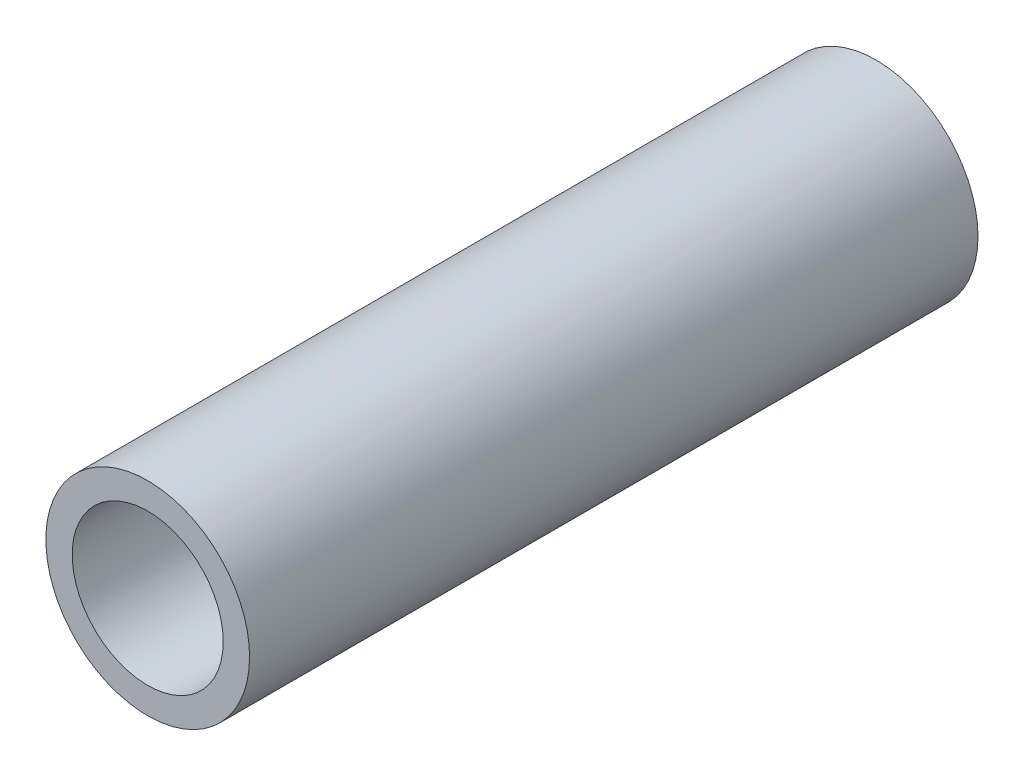
ISO-10303-21;
HEADER;
FILE_DESCRIPTION(('STEP AP214'),'2;1');
FILE_NAME('part.step','',(''),(''),'','','');
FILE_SCHEMA(('AUTOMOTIVE_DESIGN { 1 0 10303 214 1 1 1 1 }'));
ENDSEC;
DATA;
#1=APPLICATION_CONTEXT('core data for automotive mechanical design processes');
#2=APPLICATION_PROTOCOL_DEFINITION('international standard','automotive_design',2000,#1);
#3=PRODUCT_CONTEXT('',#1,'mechanical');
#4=PRODUCT('Part','Part','',(#3));
#5=PRODUCT_RELATED_PRODUCT_CATEGORY('part','',(#4));
#6=PRODUCT_DEFINITION_FORMATION('','',#4);
#7=PRODUCT_DEFINITION_CONTEXT('part definition',#1,'design');
#8=PRODUCT_DEFINITION('design','',#6,#7);
#9=PRODUCT_DEFINITION_SHAPE('','',#8);
#10=(LENGTH_UNIT() NAMED_UNIT(*) SI_UNIT(.MILLI.,.METRE.));
#11=(NAMED_UNIT(*) PLANE_ANGLE_UNIT() SI_UNIT($,.RADIAN.));
#12=(NAMED_UNIT(*) SI_UNIT($,.STERADIAN.) SOLID_ANGLE_UNIT());
#13=UNCERTAINTY_MEASURE_WITH_UNIT(LENGTH_MEASURE(1.E-05),#10,'distance_accuracy_value','');
#14=(GEOMETRIC_REPRESENTATION_CONTEXT(3) GLOBAL_UNCERTAINTY_ASSIGNED_CONTEXT((#13)) GLOBAL_UNIT_ASSIGNED_CONTEXT((#10,
#11,#12)) REPRESENTATION_CONTEXT('',''));
#15=CARTESIAN_POINT('',(0.,0.,0.));
#16=DIRECTION('',(0.,0.,1.));
#17=DIRECTION('',(1.,0.,0.));
#18=AXIS2_PLACEMENT_3D('',#15,#16,#17);
#19=CARTESIAN_POINT('',(0.,0.,76.2));
#20=DIRECTION('',(0.,0.,1.));
#21=DIRECTION('',(1.,0.,0.));
#22=AXIS2_PLACEMENT_3D('',#19,#20,#21);
#23=PLANE('',#22);
#24=CARTESIAN_POINT('',(0.,0.,76.2));
#25=DIRECTION('',(0.,0.,1.));
#26=DIRECTION('',(1.,0.,0.));
#27=AXIS2_PLACEMENT_3D('',#24,#25,#26);
#28=CIRCLE('',#27,10.6553);
#29=CARTESIAN_POINT('',(10.6553,0.,76.2));
#30=VERTEX_POINT('',#29);
#31=EDGE_CURVE('E10',#30,#30,#28,.T.);
#32=ORIENTED_EDGE('',*,*,#31,.T.);
#33=EDGE_LOOP('',(#32));
#34=FACE_BOUND('',#33,.T.);
#35=CARTESIAN_POINT('',(0.,0.,76.2));
#36=DIRECTION('',(0.,0.,1.));
#37=DIRECTION('',(1.,0.,0.));
#38=AXIS2_PLACEMENT_3D('',#35,#36,#37);
#39=CIRCLE('',#38,7.8994);
#40=CARTESIAN_POINT('',(7.8994,0.,76.2));
#41=VERTEX_POINT('',#40);
#42=EDGE_CURVE('E41',#41,#41,#39,.T.);
#43=ORIENTED_EDGE('',*,*,#42,.F.);
#44=EDGE_LOOP('',(#43));
#45=FACE_BOUND('',#44,.T.);
#46=ADVANCED_FACE('F30',(#34,#45),#23,.T.);
#47=CARTESIAN_POINT('',(0.,0.,0.));
#48=DIRECTION('',(0.,0.,1.));
#49=DIRECTION('',(1.,0.,0.));
#50=AXIS2_PLACEMENT_3D('',#47,#48,#49);
#51=PLANE('',#50);
#52=CARTESIAN_POINT('',(0.,0.,0.));
#53=DIRECTION('',(0.,0.,1.));
#54=DIRECTION('',(1.,0.,0.));
#55=AXIS2_PLACEMENT_3D('',#52,#53,#54);
#56=CIRCLE('',#55,10.6553);
#57=CARTESIAN_POINT('',(10.6553,0.,0.));
#58=VERTEX_POINT('',#57);
#59=EDGE_CURVE('E34',#58,#58,#56,.T.);
#60=ORIENTED_EDGE('',*,*,#59,.F.);
#61=EDGE_LOOP('',(#60));
#62=FACE_BOUND('',#61,.T.);
#63=CARTESIAN_POINT('',(0.,0.,0.));
#64=DIRECTION('',(0.,0.,1.));
#65=DIRECTION('',(1.,0.,0.));
#66=AXIS2_PLACEMENT_3D('',#63,#64,#65);
#67=CIRCLE('',#66,7.8994);
#68=CARTESIAN_POINT('',(7.8994,0.,0.));
#69=VERTEX_POINT('',#68);
#70=EDGE_CURVE('E43',#69,#69,#67,.T.);
#71=ORIENTED_EDGE('',*,*,#70,.T.);
#72=EDGE_LOOP('',(#71));
#73=FACE_BOUND('',#72,.T.);
#74=ADVANCED_FACE('F53',(#62,#73),#51,.F.);
#75=CARTESIAN_POINT('',(0.,0.,76.2));
#76=DIRECTION('',(0.,0.,-1.));
#77=DIRECTION('',(-1.,0.,0.));
#78=AXIS2_PLACEMENT_3D('',#75,#76,#77);
#79=CYLINDRICAL_SURFACE('',#78,10.6553);
#80=ORIENTED_EDGE('',*,*,#31,.F.);
#81=EDGE_LOOP('',(#80));
#82=FACE_BOUND('',#81,.T.);
#83=ORIENTED_EDGE('',*,*,#59,.T.);
#84=EDGE_LOOP('',(#83));
#85=FACE_BOUND('',#84,.T.);
#86=ADVANCED_FACE('F32',(#82,#85),#79,.T.);
#87=CARTESIAN_POINT('',(0.,0.,76.2));
#88=DIRECTION('',(0.,0.,-1.));
#89=DIRECTION('',(-1.,0.,0.));
#90=AXIS2_PLACEMENT_3D('',#87,#88,#89);
#91=CYLINDRICAL_SURFACE('',#90,7.8994);
#92=ORIENTED_EDGE('',*,*,#42,.T.);
#93=EDGE_LOOP('',(#92));
#94=FACE_BOUND('',#93,.T.);
#95=ORIENTED_EDGE('',*,*,#70,.F.);
#96=EDGE_LOOP('',(#95));
#97=FACE_BOUND('',#96,.T.);
#98=ADVANCED_FACE('F49',(#94,#97),#91,.F.);
#99=CLOSED_SHELL('',(#46,#74,#86,#98));
#100=MANIFOLD_SOLID_BREP('B2',#99);
#101=ADVANCED_BREP_SHAPE_REPRESENTATION('',(#18,#100),#14);
#102=SHAPE_DEFINITION_REPRESENTATION(#9,#101);
ENDSEC;
END-ISO-10303-21;
